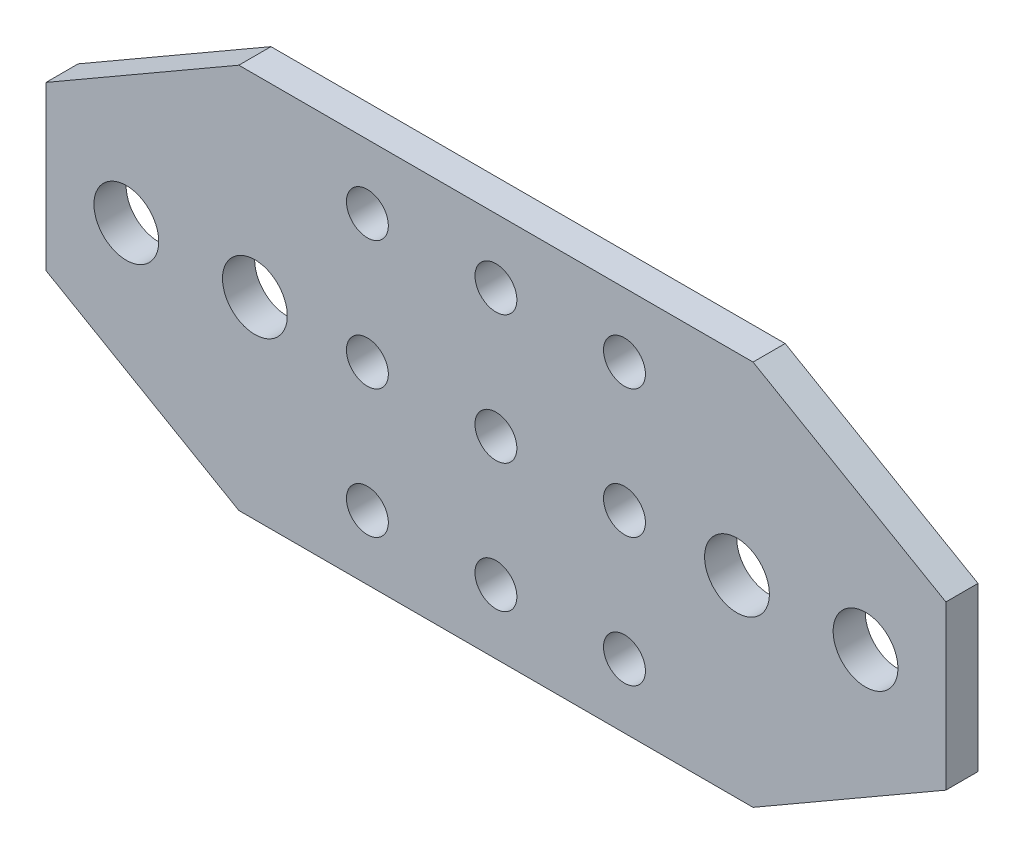
ISO-10303-21;
HEADER;
FILE_DESCRIPTION(('STEP AP214'),'2;1');
FILE_NAME('part.step','',(''),(''),'','','');
FILE_SCHEMA(('AUTOMOTIVE_DESIGN { 1 0 10303 214 1 1 1 1 }'));
ENDSEC;
DATA;
#1=APPLICATION_CONTEXT('core data for automotive mechanical design processes');
#2=APPLICATION_PROTOCOL_DEFINITION('international standard','automotive_design',2000,#1);
#3=PRODUCT_CONTEXT('',#1,'mechanical');
#4=PRODUCT('Part','Part','',(#3));
#5=PRODUCT_RELATED_PRODUCT_CATEGORY('part','',(#4));
#6=PRODUCT_DEFINITION_FORMATION('','',#4);
#7=PRODUCT_DEFINITION_CONTEXT('part definition',#1,'design');
#8=PRODUCT_DEFINITION('design','',#6,#7);
#9=PRODUCT_DEFINITION_SHAPE('','',#8);
#10=(LENGTH_UNIT() NAMED_UNIT(*) SI_UNIT(.MILLI.,.METRE.));
#11=(NAMED_UNIT(*) PLANE_ANGLE_UNIT() SI_UNIT($,.RADIAN.));
#12=(NAMED_UNIT(*) SI_UNIT($,.STERADIAN.) SOLID_ANGLE_UNIT());
#13=UNCERTAINTY_MEASURE_WITH_UNIT(LENGTH_MEASURE(1.E-05),#10,'distance_accuracy_value','');
#14=(GEOMETRIC_REPRESENTATION_CONTEXT(3) GLOBAL_UNCERTAINTY_ASSIGNED_CONTEXT((#13)) GLOBAL_UNIT_ASSIGNED_CONTEXT((#10,
#11,#12)) REPRESENTATION_CONTEXT('',''));
#15=CARTESIAN_POINT('',(0.,0.,0.));
#16=DIRECTION('',(0.,0.,1.));
#17=DIRECTION('',(1.,0.,0.));
#18=AXIS2_PLACEMENT_3D('',#15,#16,#17);
#19=CARTESIAN_POINT('',(-44.45,-19.05,0.));
#20=DIRECTION('',(0.,0.,1.));
#21=DIRECTION('',(1.,0.,0.));
#22=AXIS2_PLACEMENT_3D('',#19,#20,#21);
#23=PLANE('',#22);
#24=DIRECTION('',(0.,1.,0.));
#25=VECTOR('',#24,1.);
#26=CARTESIAN_POINT('',(-44.45,19.05,0.));
#27=LINE('',#26,#25);
#28=CARTESIAN_POINT('',(-44.45,-8.05147737193778,0.));
#29=VERTEX_POINT('',#28);
#30=CARTESIAN_POINT('',(-44.45,8.05147737193778,0.));
#31=VERTEX_POINT('',#30);
#32=EDGE_CURVE('E84',#29,#31,#27,.T.);
#33=ORIENTED_EDGE('',*,*,#32,.T.);
#34=DIRECTION('',(0.866025403784442,0.499999999999995,0.));
#35=VECTOR('',#34,1.);
#36=CARTESIAN_POINT('',(-44.45,8.05147737193778,0.));
#37=LINE('',#36,#35);
#38=CARTESIAN_POINT('',(-25.4,19.05,0.));
#39=VERTEX_POINT('',#38);
#40=EDGE_CURVE('E499',#31,#39,#37,.T.);
#41=ORIENTED_EDGE('',*,*,#40,.T.);
#42=DIRECTION('',(1.,0.,0.));
#43=VECTOR('',#42,1.);
#44=CARTESIAN_POINT('',(-44.45,19.05,0.));
#45=LINE('',#44,#43);
#46=CARTESIAN_POINT('',(25.4,19.05,0.));
#47=VERTEX_POINT('',#46);
#48=EDGE_CURVE('E504',#39,#47,#45,.T.);
#49=ORIENTED_EDGE('',*,*,#48,.T.);
#50=DIRECTION('',(0.866025403784442,-0.499999999999995,0.));
#51=VECTOR('',#50,1.);
#52=CARTESIAN_POINT('',(44.45,8.05147737193777,0.));
#53=LINE('',#52,#51);
#54=CARTESIAN_POINT('',(44.45,8.05147737193778,0.));
#55=VERTEX_POINT('',#54);
#56=EDGE_CURVE('E508',#47,#55,#53,.T.);
#57=ORIENTED_EDGE('',*,*,#56,.T.);
#58=DIRECTION('',(0.,1.,0.));
#59=VECTOR('',#58,1.);
#60=CARTESIAN_POINT('',(44.45,19.05,0.));
#61=LINE('',#60,#59);
#62=CARTESIAN_POINT('',(44.45,-8.05147737193777,0.));
#63=VERTEX_POINT('',#62);
#64=EDGE_CURVE('E486',#55,#63,#61,.F.);
#65=ORIENTED_EDGE('',*,*,#64,.T.);
#66=DIRECTION('',(-0.866025403784442,-0.499999999999995,0.));
#67=VECTOR('',#66,1.);
#68=CARTESIAN_POINT('',(44.45,-8.05147737193777,0.));
#69=LINE('',#68,#67);
#70=CARTESIAN_POINT('',(25.4,-19.05,0.));
#71=VERTEX_POINT('',#70);
#72=EDGE_CURVE('E481',#63,#71,#69,.T.);
#73=ORIENTED_EDGE('',*,*,#72,.T.);
#74=DIRECTION('',(1.,0.,0.));
#75=VECTOR('',#74,1.);
#76=CARTESIAN_POINT('',(-44.45,-19.05,0.));
#77=LINE('',#76,#75);
#78=CARTESIAN_POINT('',(-25.4,-19.05,0.));
#79=VERTEX_POINT('',#78);
#80=EDGE_CURVE('E79',#71,#79,#77,.F.);
#81=ORIENTED_EDGE('',*,*,#80,.T.);
#82=DIRECTION('',(-0.866025403784442,0.499999999999995,0.));
#83=VECTOR('',#82,1.);
#84=CARTESIAN_POINT('',(-44.45,-8.05147737193777,0.));
#85=LINE('',#84,#83);
#86=EDGE_CURVE('E81',#79,#29,#85,.T.);
#87=ORIENTED_EDGE('',*,*,#86,.T.);
#88=EDGE_LOOP('',(#33,#41,#49,#57,#65,#73,#81,#87));
#89=FACE_BOUND('',#88,.T.);
#90=CARTESIAN_POINT('',(-23.8125,0.,0.));
#91=DIRECTION('',(0.,0.,-1.));
#92=DIRECTION('',(-1.,0.,0.));
#93=AXIS2_PLACEMENT_3D('',#90,#91,#92);
#94=CIRCLE('',#93,3.2004);
#95=CARTESIAN_POINT('',(-27.0129,0.,0.));
#96=VERTEX_POINT('',#95);
#97=EDGE_CURVE('E97',#96,#96,#94,.F.);
#98=ORIENTED_EDGE('',*,*,#97,.T.);
#99=EDGE_LOOP('',(#98));
#100=FACE_BOUND('',#99,.T.);
#101=CARTESIAN_POINT('',(0.,-12.7,0.));
#102=DIRECTION('',(0.,0.,-1.));
#103=DIRECTION('',(-1.,0.,0.));
#104=AXIS2_PLACEMENT_3D('',#101,#102,#103);
#105=CIRCLE('',#104,2.0701);
#106=CARTESIAN_POINT('',(-2.07010000000001,-12.7,0.));
#107=VERTEX_POINT('',#106);
#108=EDGE_CURVE('E150',#107,#107,#105,.F.);
#109=ORIENTED_EDGE('',*,*,#108,.T.);
#110=EDGE_LOOP('',(#109));
#111=FACE_BOUND('',#110,.T.);
#112=CARTESIAN_POINT('',(0.,12.7,0.));
#113=DIRECTION('',(0.,0.,-1.));
#114=DIRECTION('',(-1.,0.,0.));
#115=AXIS2_PLACEMENT_3D('',#112,#113,#114);
#116=CIRCLE('',#115,2.0701);
#117=CARTESIAN_POINT('',(-2.07010000000001,12.7,0.));
#118=VERTEX_POINT('',#117);
#119=EDGE_CURVE('E153',#118,#118,#116,.F.);
#120=ORIENTED_EDGE('',*,*,#119,.T.);
#121=EDGE_LOOP('',(#120));
#122=FACE_BOUND('',#121,.T.);
#123=CARTESIAN_POINT('',(0.,0.,0.));
#124=DIRECTION('',(0.,0.,-1.));
#125=DIRECTION('',(-1.,0.,0.));
#126=AXIS2_PLACEMENT_3D('',#123,#124,#125);
#127=CIRCLE('',#126,2.0701);
#128=CARTESIAN_POINT('',(-2.0701,0.,0.));
#129=VERTEX_POINT('',#128);
#130=EDGE_CURVE('E156',#129,#129,#127,.F.);
#131=ORIENTED_EDGE('',*,*,#130,.T.);
#132=EDGE_LOOP('',(#131));
#133=FACE_BOUND('',#132,.T.);
#134=CARTESIAN_POINT('',(-36.5125,0.,0.));
#135=DIRECTION('',(0.,0.,-1.));
#136=DIRECTION('',(-1.,0.,0.));
#137=AXIS2_PLACEMENT_3D('',#134,#135,#136);
#138=CIRCLE('',#137,3.2004);
#139=CARTESIAN_POINT('',(-39.7129,0.,0.));
#140=VERTEX_POINT('',#139);
#141=EDGE_CURVE('E159',#140,#140,#138,.F.);
#142=ORIENTED_EDGE('',*,*,#141,.T.);
#143=EDGE_LOOP('',(#142));
#144=FACE_BOUND('',#143,.T.);
#145=CARTESIAN_POINT('',(12.7,-12.7,0.));
#146=DIRECTION('',(0.,0.,-1.));
#147=DIRECTION('',(-1.,0.,0.));
#148=AXIS2_PLACEMENT_3D('',#145,#146,#147);
#149=CIRCLE('',#148,2.0701);
#150=CARTESIAN_POINT('',(10.6299,-12.7,0.));
#151=VERTEX_POINT('',#150);
#152=EDGE_CURVE('E162',#151,#151,#149,.F.);
#153=ORIENTED_EDGE('',*,*,#152,.T.);
#154=EDGE_LOOP('',(#153));
#155=FACE_BOUND('',#154,.T.);
#156=CARTESIAN_POINT('',(-12.7,12.7,0.));
#157=DIRECTION('',(0.,0.,-1.));
#158=DIRECTION('',(-1.,0.,0.));
#159=AXIS2_PLACEMENT_3D('',#156,#157,#158);
#160=CIRCLE('',#159,2.0701);
#161=CARTESIAN_POINT('',(-14.7701,12.7,0.));
#162=VERTEX_POINT('',#161);
#163=EDGE_CURVE('E165',#162,#162,#160,.F.);
#164=ORIENTED_EDGE('',*,*,#163,.T.);
#165=EDGE_LOOP('',(#164));
#166=FACE_BOUND('',#165,.T.);
#167=CARTESIAN_POINT('',(-12.7,-12.7,0.));
#168=DIRECTION('',(0.,0.,-1.));
#169=DIRECTION('',(-1.,0.,0.));
#170=AXIS2_PLACEMENT_3D('',#167,#168,#169);
#171=CIRCLE('',#170,2.0701);
#172=CARTESIAN_POINT('',(-14.7701,-12.7,0.));
#173=VERTEX_POINT('',#172);
#174=EDGE_CURVE('E168',#173,#173,#171,.F.);
#175=ORIENTED_EDGE('',*,*,#174,.T.);
#176=EDGE_LOOP('',(#175));
#177=FACE_BOUND('',#176,.T.);
#178=CARTESIAN_POINT('',(12.7,12.7,0.));
#179=DIRECTION('',(0.,0.,-1.));
#180=DIRECTION('',(-1.,0.,0.));
#181=AXIS2_PLACEMENT_3D('',#178,#179,#180);
#182=CIRCLE('',#181,2.0701);
#183=CARTESIAN_POINT('',(10.6299,12.7,0.));
#184=VERTEX_POINT('',#183);
#185=EDGE_CURVE('E171',#184,#184,#182,.F.);
#186=ORIENTED_EDGE('',*,*,#185,.T.);
#187=EDGE_LOOP('',(#186));
#188=FACE_BOUND('',#187,.T.);
#189=CARTESIAN_POINT('',(36.5125,0.,0.));
#190=DIRECTION('',(0.,0.,-1.));
#191=DIRECTION('',(-1.,0.,0.));
#192=AXIS2_PLACEMENT_3D('',#189,#190,#191);
#193=CIRCLE('',#192,3.2004);
#194=CARTESIAN_POINT('',(33.3121,0.,0.));
#195=VERTEX_POINT('',#194);
#196=EDGE_CURVE('E174',#195,#195,#193,.F.);
#197=ORIENTED_EDGE('',*,*,#196,.T.);
#198=EDGE_LOOP('',(#197));
#199=FACE_BOUND('',#198,.T.);
#200=CARTESIAN_POINT('',(-12.7,0.,0.));
#201=DIRECTION('',(0.,0.,-1.));
#202=DIRECTION('',(-1.,0.,0.));
#203=AXIS2_PLACEMENT_3D('',#200,#201,#202);
#204=CIRCLE('',#203,2.0701);
#205=CARTESIAN_POINT('',(-14.7701,0.,0.));
#206=VERTEX_POINT('',#205);
#207=EDGE_CURVE('E177',#206,#206,#204,.F.);
#208=ORIENTED_EDGE('',*,*,#207,.T.);
#209=EDGE_LOOP('',(#208));
#210=FACE_BOUND('',#209,.T.);
#211=CARTESIAN_POINT('',(12.7,0.,0.));
#212=DIRECTION('',(0.,0.,-1.));
#213=DIRECTION('',(-1.,0.,0.));
#214=AXIS2_PLACEMENT_3D('',#211,#212,#213);
#215=CIRCLE('',#214,2.0701);
#216=CARTESIAN_POINT('',(10.6299,0.,0.));
#217=VERTEX_POINT('',#216);
#218=EDGE_CURVE('E179',#217,#217,#215,.F.);
#219=ORIENTED_EDGE('',*,*,#218,.T.);
#220=EDGE_LOOP('',(#219));
#221=FACE_BOUND('',#220,.T.);
#222=CARTESIAN_POINT('',(23.8125,0.,0.));
#223=DIRECTION('',(0.,0.,-1.));
#224=DIRECTION('',(-1.,0.,0.));
#225=AXIS2_PLACEMENT_3D('',#222,#223,#224);
#226=CIRCLE('',#225,3.2004);
#227=CARTESIAN_POINT('',(20.6121,0.,0.));
#228=VERTEX_POINT('',#227);
#229=EDGE_CURVE('E19',#228,#228,#226,.F.);
#230=ORIENTED_EDGE('',*,*,#229,.T.);
#231=EDGE_LOOP('',(#230));
#232=FACE_BOUND('',#231,.T.);
#233=ADVANCED_FACE('F16',(#89,#100,#111,#122,#133,#144,#155,#166,#177,#188,#199,#210,#221,#232),
#23,.F.);
#234=CARTESIAN_POINT('',(23.8125,0.,3.175));
#235=DIRECTION('',(0.,0.,-1.));
#236=DIRECTION('',(-1.,0.,0.));
#237=AXIS2_PLACEMENT_3D('',#234,#235,#236);
#238=CYLINDRICAL_SURFACE('',#237,3.2004);
#239=CARTESIAN_POINT('',(23.8125,0.,3.175));
#240=DIRECTION('',(0.,0.,-1.));
#241=DIRECTION('',(-1.,0.,0.));
#242=AXIS2_PLACEMENT_3D('',#239,#240,#241);
#243=CIRCLE('',#242,3.2004);
#244=CARTESIAN_POINT('',(20.6121,0.,3.175));
#245=VERTEX_POINT('',#244);
#246=EDGE_CURVE('E145',#245,#245,#243,.T.);
#247=ORIENTED_EDGE('',*,*,#246,.F.);
#248=EDGE_LOOP('',(#247));
#249=FACE_BOUND('',#248,.T.);
#250=ORIENTED_EDGE('',*,*,#229,.F.);
#251=EDGE_LOOP('',(#250));
#252=FACE_BOUND('',#251,.T.);
#253=ADVANCED_FACE('F187',(#249,#252),#238,.F.);
#254=CARTESIAN_POINT('',(12.7,0.,3.175));
#255=DIRECTION('',(0.,0.,-1.));
#256=DIRECTION('',(-1.,0.,0.));
#257=AXIS2_PLACEMENT_3D('',#254,#255,#256);
#258=CYLINDRICAL_SURFACE('',#257,2.0701);
#259=CARTESIAN_POINT('',(12.7,0.,3.175));
#260=DIRECTION('',(0.,0.,-1.));
#261=DIRECTION('',(-1.,0.,0.));
#262=AXIS2_PLACEMENT_3D('',#259,#260,#261);
#263=CIRCLE('',#262,2.0701);
#264=CARTESIAN_POINT('',(10.6299,0.,3.175));
#265=VERTEX_POINT('',#264);
#266=EDGE_CURVE('E142',#265,#265,#263,.T.);
#267=ORIENTED_EDGE('',*,*,#266,.F.);
#268=EDGE_LOOP('',(#267));
#269=FACE_BOUND('',#268,.T.);
#270=ORIENTED_EDGE('',*,*,#218,.F.);
#271=EDGE_LOOP('',(#270));
#272=FACE_BOUND('',#271,.T.);
#273=ADVANCED_FACE('F189',(#269,#272),#258,.F.);
#274=CARTESIAN_POINT('',(-12.7,0.,3.175));
#275=DIRECTION('',(0.,0.,-1.));
#276=DIRECTION('',(-1.,0.,0.));
#277=AXIS2_PLACEMENT_3D('',#274,#275,#276);
#278=CYLINDRICAL_SURFACE('',#277,2.0701);
#279=CARTESIAN_POINT('',(-12.7,0.,3.175));
#280=DIRECTION('',(0.,0.,-1.));
#281=DIRECTION('',(-1.,0.,0.));
#282=AXIS2_PLACEMENT_3D('',#279,#280,#281);
#283=CIRCLE('',#282,2.0701);
#284=CARTESIAN_POINT('',(-14.7701,0.,3.175));
#285=VERTEX_POINT('',#284);
#286=EDGE_CURVE('E139',#285,#285,#283,.T.);
#287=ORIENTED_EDGE('',*,*,#286,.F.);
#288=EDGE_LOOP('',(#287));
#289=FACE_BOUND('',#288,.T.);
#290=ORIENTED_EDGE('',*,*,#207,.F.);
#291=EDGE_LOOP('',(#290));
#292=FACE_BOUND('',#291,.T.);
#293=ADVANCED_FACE('F196',(#289,#292),#278,.F.);
#294=CARTESIAN_POINT('',(36.5125,0.,3.175));
#295=DIRECTION('',(0.,0.,-1.));
#296=DIRECTION('',(-1.,0.,0.));
#297=AXIS2_PLACEMENT_3D('',#294,#295,#296);
#298=CYLINDRICAL_SURFACE('',#297,3.2004);
#299=CARTESIAN_POINT('',(36.5125,0.,3.175));
#300=DIRECTION('',(0.,0.,-1.));
#301=DIRECTION('',(-1.,0.,0.));
#302=AXIS2_PLACEMENT_3D('',#299,#300,#301);
#303=CIRCLE('',#302,3.2004);
#304=CARTESIAN_POINT('',(33.3121,0.,3.175));
#305=VERTEX_POINT('',#304);
#306=EDGE_CURVE('E136',#305,#305,#303,.T.);
#307=ORIENTED_EDGE('',*,*,#306,.F.);
#308=EDGE_LOOP('',(#307));
#309=FACE_BOUND('',#308,.T.);
#310=ORIENTED_EDGE('',*,*,#196,.F.);
#311=EDGE_LOOP('',(#310));
#312=FACE_BOUND('',#311,.T.);
#313=ADVANCED_FACE('F271',(#309,#312),#298,.F.);
#314=CARTESIAN_POINT('',(12.7,12.7,3.175));
#315=DIRECTION('',(0.,0.,-1.));
#316=DIRECTION('',(-1.,0.,0.));
#317=AXIS2_PLACEMENT_3D('',#314,#315,#316);
#318=CYLINDRICAL_SURFACE('',#317,2.0701);
#319=CARTESIAN_POINT('',(12.7,12.7,3.175));
#320=DIRECTION('',(0.,0.,-1.));
#321=DIRECTION('',(-1.,0.,0.));
#322=AXIS2_PLACEMENT_3D('',#319,#320,#321);
#323=CIRCLE('',#322,2.0701);
#324=CARTESIAN_POINT('',(10.6299,12.7,3.175));
#325=VERTEX_POINT('',#324);
#326=EDGE_CURVE('E133',#325,#325,#323,.T.);
#327=ORIENTED_EDGE('',*,*,#326,.F.);
#328=EDGE_LOOP('',(#327));
#329=FACE_BOUND('',#328,.T.);
#330=ORIENTED_EDGE('',*,*,#185,.F.);
#331=EDGE_LOOP('',(#330));
#332=FACE_BOUND('',#331,.T.);
#333=ADVANCED_FACE('F267',(#329,#332),#318,.F.);
#334=CARTESIAN_POINT('',(-12.7,-12.7,3.175));
#335=DIRECTION('',(0.,0.,-1.));
#336=DIRECTION('',(-1.,0.,0.));
#337=AXIS2_PLACEMENT_3D('',#334,#335,#336);
#338=CYLINDRICAL_SURFACE('',#337,2.0701);
#339=CARTESIAN_POINT('',(-12.7,-12.7,3.175));
#340=DIRECTION('',(0.,0.,-1.));
#341=DIRECTION('',(-1.,0.,0.));
#342=AXIS2_PLACEMENT_3D('',#339,#340,#341);
#343=CIRCLE('',#342,2.0701);
#344=CARTESIAN_POINT('',(-14.7701,-12.7,3.175));
#345=VERTEX_POINT('',#344);
#346=EDGE_CURVE('E130',#345,#345,#343,.T.);
#347=ORIENTED_EDGE('',*,*,#346,.F.);
#348=EDGE_LOOP('',(#347));
#349=FACE_BOUND('',#348,.T.);
#350=ORIENTED_EDGE('',*,*,#174,.F.);
#351=EDGE_LOOP('',(#350));
#352=FACE_BOUND('',#351,.T.);
#353=ADVANCED_FACE('F263',(#349,#352),#338,.F.);
#354=CARTESIAN_POINT('',(-12.7,12.7,3.175));
#355=DIRECTION('',(0.,0.,-1.));
#356=DIRECTION('',(-1.,0.,0.));
#357=AXIS2_PLACEMENT_3D('',#354,#355,#356);
#358=CYLINDRICAL_SURFACE('',#357,2.0701);
#359=CARTESIAN_POINT('',(-12.7,12.7,3.175));
#360=DIRECTION('',(0.,0.,-1.));
#361=DIRECTION('',(-1.,0.,0.));
#362=AXIS2_PLACEMENT_3D('',#359,#360,#361);
#363=CIRCLE('',#362,2.0701);
#364=CARTESIAN_POINT('',(-14.7701,12.7,3.175));
#365=VERTEX_POINT('',#364);
#366=EDGE_CURVE('E127',#365,#365,#363,.T.);
#367=ORIENTED_EDGE('',*,*,#366,.F.);
#368=EDGE_LOOP('',(#367));
#369=FACE_BOUND('',#368,.T.);
#370=ORIENTED_EDGE('',*,*,#163,.F.);
#371=EDGE_LOOP('',(#370));
#372=FACE_BOUND('',#371,.T.);
#373=ADVANCED_FACE('F259',(#369,#372),#358,.F.);
#374=CARTESIAN_POINT('',(12.7,-12.7,3.175));
#375=DIRECTION('',(0.,0.,-1.));
#376=DIRECTION('',(-1.,0.,0.));
#377=AXIS2_PLACEMENT_3D('',#374,#375,#376);
#378=CYLINDRICAL_SURFACE('',#377,2.0701);
#379=CARTESIAN_POINT('',(12.7,-12.7,3.175));
#380=DIRECTION('',(0.,0.,-1.));
#381=DIRECTION('',(-1.,0.,0.));
#382=AXIS2_PLACEMENT_3D('',#379,#380,#381);
#383=CIRCLE('',#382,2.0701);
#384=CARTESIAN_POINT('',(10.6299,-12.7,3.175));
#385=VERTEX_POINT('',#384);
#386=EDGE_CURVE('E124',#385,#385,#383,.T.);
#387=ORIENTED_EDGE('',*,*,#386,.F.);
#388=EDGE_LOOP('',(#387));
#389=FACE_BOUND('',#388,.T.);
#390=ORIENTED_EDGE('',*,*,#152,.F.);
#391=EDGE_LOOP('',(#390));
#392=FACE_BOUND('',#391,.T.);
#393=ADVANCED_FACE('F255',(#389,#392),#378,.F.);
#394=CARTESIAN_POINT('',(-36.5125,0.,3.175));
#395=DIRECTION('',(0.,0.,-1.));
#396=DIRECTION('',(-1.,0.,0.));
#397=AXIS2_PLACEMENT_3D('',#394,#395,#396);
#398=CYLINDRICAL_SURFACE('',#397,3.2004);
#399=CARTESIAN_POINT('',(-36.5125,0.,3.175));
#400=DIRECTION('',(0.,0.,-1.));
#401=DIRECTION('',(-1.,0.,0.));
#402=AXIS2_PLACEMENT_3D('',#399,#400,#401);
#403=CIRCLE('',#402,3.2004);
#404=CARTESIAN_POINT('',(-39.7129,0.,3.175));
#405=VERTEX_POINT('',#404);
#406=EDGE_CURVE('E121',#405,#405,#403,.T.);
#407=ORIENTED_EDGE('',*,*,#406,.F.);
#408=EDGE_LOOP('',(#407));
#409=FACE_BOUND('',#408,.T.);
#410=ORIENTED_EDGE('',*,*,#141,.F.);
#411=EDGE_LOOP('',(#410));
#412=FACE_BOUND('',#411,.T.);
#413=ADVANCED_FACE('F251',(#409,#412),#398,.F.);
#414=CARTESIAN_POINT('',(0.,0.,3.175));
#415=DIRECTION('',(0.,0.,-1.));
#416=DIRECTION('',(-1.,0.,0.));
#417=AXIS2_PLACEMENT_3D('',#414,#415,#416);
#418=CYLINDRICAL_SURFACE('',#417,2.0701);
#419=CARTESIAN_POINT('',(0.,0.,3.175));
#420=DIRECTION('',(0.,0.,-1.));
#421=DIRECTION('',(-1.,0.,0.));
#422=AXIS2_PLACEMENT_3D('',#419,#420,#421);
#423=CIRCLE('',#422,2.0701);
#424=CARTESIAN_POINT('',(-2.0701,0.,3.175));
#425=VERTEX_POINT('',#424);
#426=EDGE_CURVE('E118',#425,#425,#423,.T.);
#427=ORIENTED_EDGE('',*,*,#426,.F.);
#428=EDGE_LOOP('',(#427));
#429=FACE_BOUND('',#428,.T.);
#430=ORIENTED_EDGE('',*,*,#130,.F.);
#431=EDGE_LOOP('',(#430));
#432=FACE_BOUND('',#431,.T.);
#433=ADVANCED_FACE('F247',(#429,#432),#418,.F.);
#434=CARTESIAN_POINT('',(0.,12.7,3.175));
#435=DIRECTION('',(0.,0.,-1.));
#436=DIRECTION('',(-1.,0.,0.));
#437=AXIS2_PLACEMENT_3D('',#434,#435,#436);
#438=CYLINDRICAL_SURFACE('',#437,2.0701);
#439=CARTESIAN_POINT('',(0.,12.7,3.175));
#440=DIRECTION('',(0.,0.,-1.));
#441=DIRECTION('',(-1.,0.,0.));
#442=AXIS2_PLACEMENT_3D('',#439,#440,#441);
#443=CIRCLE('',#442,2.0701);
#444=CARTESIAN_POINT('',(-2.07010000000001,12.7,3.175));
#445=VERTEX_POINT('',#444);
#446=EDGE_CURVE('E115',#445,#445,#443,.T.);
#447=ORIENTED_EDGE('',*,*,#446,.F.);
#448=EDGE_LOOP('',(#447));
#449=FACE_BOUND('',#448,.T.);
#450=ORIENTED_EDGE('',*,*,#119,.F.);
#451=EDGE_LOOP('',(#450));
#452=FACE_BOUND('',#451,.T.);
#453=ADVANCED_FACE('F243',(#449,#452),#438,.F.);
#454=CARTESIAN_POINT('',(0.,-12.7,3.175));
#455=DIRECTION('',(0.,0.,-1.));
#456=DIRECTION('',(-1.,0.,0.));
#457=AXIS2_PLACEMENT_3D('',#454,#455,#456);
#458=CYLINDRICAL_SURFACE('',#457,2.0701);
#459=CARTESIAN_POINT('',(0.,-12.7,3.175));
#460=DIRECTION('',(0.,0.,-1.));
#461=DIRECTION('',(-1.,0.,0.));
#462=AXIS2_PLACEMENT_3D('',#459,#460,#461);
#463=CIRCLE('',#462,2.0701);
#464=CARTESIAN_POINT('',(-2.07010000000001,-12.7,3.175));
#465=VERTEX_POINT('',#464);
#466=EDGE_CURVE('E112',#465,#465,#463,.T.);
#467=ORIENTED_EDGE('',*,*,#466,.F.);
#468=EDGE_LOOP('',(#467));
#469=FACE_BOUND('',#468,.T.);
#470=ORIENTED_EDGE('',*,*,#108,.F.);
#471=EDGE_LOOP('',(#470));
#472=FACE_BOUND('',#471,.T.);
#473=ADVANCED_FACE('F239',(#469,#472),#458,.F.);
#474=CARTESIAN_POINT('',(-23.8125,0.,3.175));
#475=DIRECTION('',(0.,0.,-1.));
#476=DIRECTION('',(-1.,0.,0.));
#477=AXIS2_PLACEMENT_3D('',#474,#475,#476);
#478=CYLINDRICAL_SURFACE('',#477,3.2004);
#479=CARTESIAN_POINT('',(-23.8125,0.,3.175));
#480=DIRECTION('',(0.,0.,-1.));
#481=DIRECTION('',(-1.,0.,0.));
#482=AXIS2_PLACEMENT_3D('',#479,#480,#481);
#483=CIRCLE('',#482,3.2004);
#484=CARTESIAN_POINT('',(-27.0129,0.,3.175));
#485=VERTEX_POINT('',#484);
#486=EDGE_CURVE('E108',#485,#485,#483,.T.);
#487=ORIENTED_EDGE('',*,*,#486,.F.);
#488=EDGE_LOOP('',(#487));
#489=FACE_BOUND('',#488,.T.);
#490=ORIENTED_EDGE('',*,*,#97,.F.);
#491=EDGE_LOOP('',(#490));
#492=FACE_BOUND('',#491,.T.);
#493=ADVANCED_FACE('F236',(#489,#492),#478,.F.);
#494=CARTESIAN_POINT('',(-44.45,19.05,3.175));
#495=DIRECTION('',(1.,0.,0.));
#496=DIRECTION('',(0.,0.,-1.));
#497=AXIS2_PLACEMENT_3D('',#494,#495,#496);
#498=PLANE('',#497);
#499=DIRECTION('',(0.,1.,0.));
#500=VECTOR('',#499,1.);
#501=CARTESIAN_POINT('',(-44.45,-19.05,3.175));
#502=LINE('',#501,#500);
#503=CARTESIAN_POINT('',(-44.45,8.05147737193778,3.175));
#504=VERTEX_POINT('',#503);
#505=CARTESIAN_POINT('',(-44.45,-8.05147737193777,3.175));
#506=VERTEX_POINT('',#505);
#507=EDGE_CURVE('E111',#504,#506,#502,.F.);
#508=ORIENTED_EDGE('',*,*,#507,.F.);
#509=DIRECTION('',(0.,0.,1.));
#510=VECTOR('',#509,1.);
#511=CARTESIAN_POINT('',(-44.45,8.05147737193778,3.175));
#512=LINE('',#511,#510);
#513=EDGE_CURVE('E95',#504,#31,#512,.F.);
#514=ORIENTED_EDGE('',*,*,#513,.T.);
#515=ORIENTED_EDGE('',*,*,#32,.F.);
#516=DIRECTION('',(0.,0.,1.));
#517=VECTOR('',#516,1.);
#518=CARTESIAN_POINT('',(-44.45,-8.05147737193777,3.175));
#519=LINE('',#518,#517);
#520=EDGE_CURVE('E89',#29,#506,#519,.T.);
#521=ORIENTED_EDGE('',*,*,#520,.T.);
#522=EDGE_LOOP('',(#508,#514,#515,#521));
#523=FACE_BOUND('',#522,.T.);
#524=ADVANCED_FACE('F92',(#523),#498,.F.);
#525=CARTESIAN_POINT('',(-44.45,-8.05147737193777,3.175));
#526=DIRECTION('',(0.499999999999995,0.866025403784442,0.));
#527=DIRECTION('',(-0.866025403784442,0.499999999999995,0.));
#528=AXIS2_PLACEMENT_3D('',#525,#526,#527);
#529=PLANE('',#528);
#530=ORIENTED_EDGE('',*,*,#520,.F.);
#531=ORIENTED_EDGE('',*,*,#86,.F.);
#532=DIRECTION('',(0.,0.,1.));
#533=VECTOR('',#532,1.);
#534=CARTESIAN_POINT('',(-25.4,-19.05,3.175));
#535=LINE('',#534,#533);
#536=CARTESIAN_POINT('',(-25.4,-19.05,3.175));
#537=VERTEX_POINT('',#536);
#538=EDGE_CURVE('E104',#79,#537,#535,.T.);
#539=ORIENTED_EDGE('',*,*,#538,.T.);
#540=DIRECTION('',(0.866025403784442,-0.499999999999995,0.));
#541=VECTOR('',#540,1.);
#542=CARTESIAN_POINT('',(-44.45,-8.05147737193777,3.175));
#543=LINE('',#542,#541);
#544=EDGE_CURVE('E101',#506,#537,#543,.T.);
#545=ORIENTED_EDGE('',*,*,#544,.F.);
#546=EDGE_LOOP('',(#530,#531,#539,#545));
#547=FACE_BOUND('',#546,.T.);
#548=ADVANCED_FACE('F99',(#547),#529,.F.);
#549=CARTESIAN_POINT('',(-44.45,-19.05,3.175));
#550=DIRECTION('',(0.,1.,0.));
#551=DIRECTION('',(0.,0.,1.));
#552=AXIS2_PLACEMENT_3D('',#549,#550,#551);
#553=PLANE('',#552);
#554=ORIENTED_EDGE('',*,*,#80,.F.);
#555=DIRECTION('',(0.,0.,1.));
#556=VECTOR('',#555,1.);
#557=CARTESIAN_POINT('',(25.4,-19.05,3.175));
#558=LINE('',#557,#556);
#559=CARTESIAN_POINT('',(25.4,-19.05,3.175));
#560=VERTEX_POINT('',#559);
#561=EDGE_CURVE('E478',#71,#560,#558,.T.);
#562=ORIENTED_EDGE('',*,*,#561,.T.);
#563=DIRECTION('',(1.,0.,0.));
#564=VECTOR('',#563,1.);
#565=CARTESIAN_POINT('',(-44.45,-19.05,3.175));
#566=LINE('',#565,#564);
#567=EDGE_CURVE('E492',#537,#560,#566,.T.);
#568=ORIENTED_EDGE('',*,*,#567,.F.);
#569=ORIENTED_EDGE('',*,*,#538,.F.);
#570=EDGE_LOOP('',(#554,#562,#568,#569));
#571=FACE_BOUND('',#570,.T.);
#572=ADVANCED_FACE('F227',(#571),#553,.F.);
#573=CARTESIAN_POINT('',(44.45,-8.05147737193777,3.175));
#574=DIRECTION('',(-0.499999999999995,0.866025403784442,0.));
#575=DIRECTION('',(-0.866025403784442,-0.499999999999995,0.));
#576=AXIS2_PLACEMENT_3D('',#573,#574,#575);
#577=PLANE('',#576);
#578=ORIENTED_EDGE('',*,*,#561,.F.);
#579=ORIENTED_EDGE('',*,*,#72,.F.);
#580=DIRECTION('',(0.,0.,1.));
#581=VECTOR('',#580,1.);
#582=CARTESIAN_POINT('',(44.45,-8.05147737193776,3.175));
#583=LINE('',#582,#581);
#584=CARTESIAN_POINT('',(44.45,-8.05147737193777,3.175));
#585=VERTEX_POINT('',#584);
#586=EDGE_CURVE('E488',#63,#585,#583,.T.);
#587=ORIENTED_EDGE('',*,*,#586,.T.);
#588=DIRECTION('',(0.866025403784441,0.499999999999995,0.));
#589=VECTOR('',#588,1.);
#590=CARTESIAN_POINT('',(25.4,-19.05,3.175));
#591=LINE('',#590,#589);
#592=EDGE_CURVE('E484',#560,#585,#591,.T.);
#593=ORIENTED_EDGE('',*,*,#592,.F.);
#594=EDGE_LOOP('',(#578,#579,#587,#593));
#595=FACE_BOUND('',#594,.T.);
#596=ADVANCED_FACE('F223',(#595),#577,.F.);
#597=CARTESIAN_POINT('',(44.45,19.05,3.175));
#598=DIRECTION('',(-1.,0.,0.));
#599=DIRECTION('',(0.,0.,1.));
#600=AXIS2_PLACEMENT_3D('',#597,#598,#599);
#601=PLANE('',#600);
#602=DIRECTION('',(0.,1.,0.));
#603=VECTOR('',#602,1.);
#604=CARTESIAN_POINT('',(44.45,-19.05,3.175));
#605=LINE('',#604,#603);
#606=CARTESIAN_POINT('',(44.45,8.05147737193778,3.175));
#607=VERTEX_POINT('',#606);
#608=EDGE_CURVE('E512',#585,#607,#605,.T.);
#609=ORIENTED_EDGE('',*,*,#608,.F.);
#610=ORIENTED_EDGE('',*,*,#586,.F.);
#611=ORIENTED_EDGE('',*,*,#64,.F.);
#612=DIRECTION('',(0.,0.,1.));
#613=VECTOR('',#612,1.);
#614=CARTESIAN_POINT('',(44.45,8.05147737193777,3.175));
#615=LINE('',#614,#613);
#616=EDGE_CURVE('E506',#55,#607,#615,.T.);
#617=ORIENTED_EDGE('',*,*,#616,.T.);
#618=EDGE_LOOP('',(#609,#610,#611,#617));
#619=FACE_BOUND('',#618,.T.);
#620=ADVANCED_FACE('F219',(#619),#601,.F.);
#621=CARTESIAN_POINT('',(44.45,8.05147737193777,3.175));
#622=DIRECTION('',(-0.499999999999995,-0.866025403784442,0.));
#623=DIRECTION('',(0.866025403784442,-0.499999999999995,0.));
#624=AXIS2_PLACEMENT_3D('',#621,#622,#623);
#625=PLANE('',#624);
#626=ORIENTED_EDGE('',*,*,#616,.F.);
#627=ORIENTED_EDGE('',*,*,#56,.F.);
#628=DIRECTION('',(0.,0.,-1.));
#629=VECTOR('',#628,1.);
#630=CARTESIAN_POINT('',(25.4,19.05,3.175));
#631=LINE('',#630,#629);
#632=CARTESIAN_POINT('',(25.4,19.05,3.175));
#633=VERTEX_POINT('',#632);
#634=EDGE_CURVE('E502',#47,#633,#631,.F.);
#635=ORIENTED_EDGE('',*,*,#634,.T.);
#636=DIRECTION('',(-0.866025403784442,0.499999999999995,0.));
#637=VECTOR('',#636,1.);
#638=CARTESIAN_POINT('',(44.45,8.05147737193778,3.175));
#639=LINE('',#638,#637);
#640=EDGE_CURVE('E516',#607,#633,#639,.T.);
#641=ORIENTED_EDGE('',*,*,#640,.F.);
#642=EDGE_LOOP('',(#626,#627,#635,#641));
#643=FACE_BOUND('',#642,.T.);
#644=ADVANCED_FACE('F216',(#643),#625,.F.);
#645=CARTESIAN_POINT('',(-44.45,19.05,3.175));
#646=DIRECTION('',(0.,-1.,0.));
#647=DIRECTION('',(0.,0.,-1.));
#648=AXIS2_PLACEMENT_3D('',#645,#646,#647);
#649=PLANE('',#648);
#650=ORIENTED_EDGE('',*,*,#48,.F.);
#651=DIRECTION('',(0.,0.,1.));
#652=VECTOR('',#651,1.);
#653=CARTESIAN_POINT('',(-25.4,19.05,3.175));
#654=LINE('',#653,#652);
#655=CARTESIAN_POINT('',(-25.4,19.05,3.175));
#656=VERTEX_POINT('',#655);
#657=EDGE_CURVE('E34',#39,#656,#654,.T.);
#658=ORIENTED_EDGE('',*,*,#657,.T.);
#659=DIRECTION('',(1.,0.,0.));
#660=VECTOR('',#659,1.);
#661=CARTESIAN_POINT('',(-44.45,19.05,3.175));
#662=LINE('',#661,#660);
#663=EDGE_CURVE('E25',#633,#656,#662,.F.);
#664=ORIENTED_EDGE('',*,*,#663,.F.);
#665=ORIENTED_EDGE('',*,*,#634,.F.);
#666=EDGE_LOOP('',(#650,#658,#664,#665));
#667=FACE_BOUND('',#666,.T.);
#668=ADVANCED_FACE('F208',(#667),#649,.F.);
#669=CARTESIAN_POINT('',(-44.45,8.05147737193778,3.175));
#670=DIRECTION('',(0.499999999999995,-0.866025403784442,0.));
#671=DIRECTION('',(0.866025403784442,0.499999999999995,0.));
#672=AXIS2_PLACEMENT_3D('',#669,#670,#671);
#673=PLANE('',#672);
#674=ORIENTED_EDGE('',*,*,#657,.F.);
#675=ORIENTED_EDGE('',*,*,#40,.F.);
#676=ORIENTED_EDGE('',*,*,#513,.F.);
#677=DIRECTION('',(-0.866025403784442,-0.499999999999995,0.));
#678=VECTOR('',#677,1.);
#679=CARTESIAN_POINT('',(-25.4,19.05,3.175));
#680=LINE('',#679,#678);
#681=EDGE_CURVE('E10',#656,#504,#680,.T.);
#682=ORIENTED_EDGE('',*,*,#681,.F.);
#683=EDGE_LOOP('',(#674,#675,#676,#682));
#684=FACE_BOUND('',#683,.T.);
#685=ADVANCED_FACE('F202',(#684),#673,.F.);
#686=CARTESIAN_POINT('',(-44.45,-19.05,3.175));
#687=DIRECTION('',(0.,0.,1.));
#688=DIRECTION('',(1.,0.,0.));
#689=AXIS2_PLACEMENT_3D('',#686,#687,#688);
#690=PLANE('',#689);
#691=ORIENTED_EDGE('',*,*,#663,.T.);
#692=ORIENTED_EDGE('',*,*,#681,.T.);
#693=ORIENTED_EDGE('',*,*,#507,.T.);
#694=ORIENTED_EDGE('',*,*,#544,.T.);
#695=ORIENTED_EDGE('',*,*,#567,.T.);
#696=ORIENTED_EDGE('',*,*,#592,.T.);
#697=ORIENTED_EDGE('',*,*,#608,.T.);
#698=ORIENTED_EDGE('',*,*,#640,.T.);
#699=EDGE_LOOP('',(#691,#692,#693,#694,#695,#696,#697,#698));
#700=FACE_BOUND('',#699,.T.);
#701=ORIENTED_EDGE('',*,*,#486,.T.);
#702=EDGE_LOOP('',(#701));
#703=FACE_BOUND('',#702,.T.);
#704=ORIENTED_EDGE('',*,*,#466,.T.);
#705=EDGE_LOOP('',(#704));
#706=FACE_BOUND('',#705,.T.);
#707=ORIENTED_EDGE('',*,*,#446,.T.);
#708=EDGE_LOOP('',(#707));
#709=FACE_BOUND('',#708,.T.);
#710=ORIENTED_EDGE('',*,*,#426,.T.);
#711=EDGE_LOOP('',(#710));
#712=FACE_BOUND('',#711,.T.);
#713=ORIENTED_EDGE('',*,*,#406,.T.);
#714=EDGE_LOOP('',(#713));
#715=FACE_BOUND('',#714,.T.);
#716=ORIENTED_EDGE('',*,*,#386,.T.);
#717=EDGE_LOOP('',(#716));
#718=FACE_BOUND('',#717,.T.);
#719=ORIENTED_EDGE('',*,*,#366,.T.);
#720=EDGE_LOOP('',(#719));
#721=FACE_BOUND('',#720,.T.);
#722=ORIENTED_EDGE('',*,*,#346,.T.);
#723=EDGE_LOOP('',(#722));
#724=FACE_BOUND('',#723,.T.);
#725=ORIENTED_EDGE('',*,*,#326,.T.);
#726=EDGE_LOOP('',(#725));
#727=FACE_BOUND('',#726,.T.);
#728=ORIENTED_EDGE('',*,*,#306,.T.);
#729=EDGE_LOOP('',(#728));
#730=FACE_BOUND('',#729,.T.);
#731=ORIENTED_EDGE('',*,*,#286,.T.);
#732=EDGE_LOOP('',(#731));
#733=FACE_BOUND('',#732,.T.);
#734=ORIENTED_EDGE('',*,*,#266,.T.);
#735=EDGE_LOOP('',(#734));
#736=FACE_BOUND('',#735,.T.);
#737=ORIENTED_EDGE('',*,*,#246,.T.);
#738=EDGE_LOOP('',(#737));
#739=FACE_BOUND('',#738,.T.);
#740=ADVANCED_FACE('F200',(#700,#703,#706,#709,#712,#715,#718,#721,#724,#727,#730,#733,#736,
#739),#690,.T.);
#741=CLOSED_SHELL('',(#233,#253,#273,#293,#313,#333,#353,#373,#393,#413,#433,#453,#473,#493,
#524,#548,#572,#596,#620,#644,#668,#685,#740));
#742=MANIFOLD_SOLID_BREP('B1',#741);
#743=ADVANCED_BREP_SHAPE_REPRESENTATION('',(#18,#742),#14);
#744=SHAPE_DEFINITION_REPRESENTATION(#9,#743);
ENDSEC;
END-ISO-10303-21;
